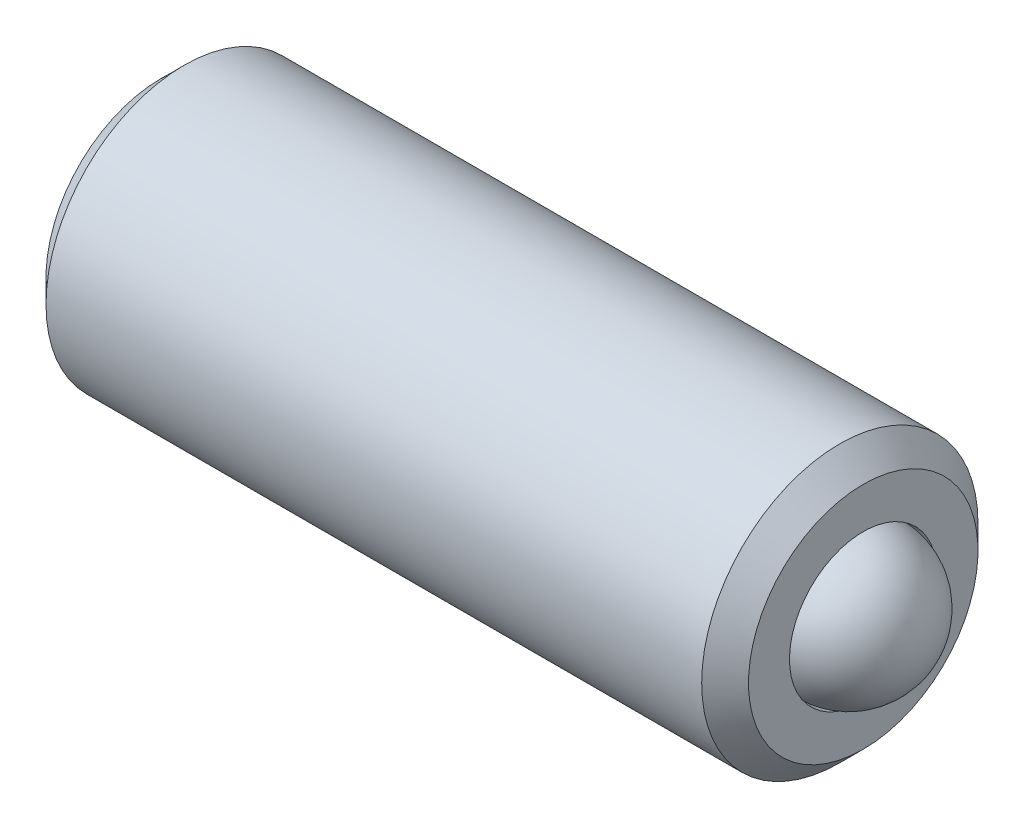
ISO-10303-21;
HEADER;
FILE_DESCRIPTION(('STEP AP214'),'2;1');
FILE_NAME('part.step','',(''),(''),'','','');
FILE_SCHEMA(('AUTOMOTIVE_DESIGN { 1 0 10303 214 1 1 1 1 }'));
ENDSEC;
DATA;
#1=APPLICATION_CONTEXT('core data for automotive mechanical design processes');
#2=APPLICATION_PROTOCOL_DEFINITION('international standard','automotive_design',2000,#1);
#3=PRODUCT_CONTEXT('',#1,'mechanical');
#4=PRODUCT('Part','Part','',(#3));
#5=PRODUCT_RELATED_PRODUCT_CATEGORY('part','',(#4));
#6=PRODUCT_DEFINITION_FORMATION('','',#4);
#7=PRODUCT_DEFINITION_CONTEXT('part definition',#1,'design');
#8=PRODUCT_DEFINITION('design','',#6,#7);
#9=PRODUCT_DEFINITION_SHAPE('','',#8);
#10=(LENGTH_UNIT() NAMED_UNIT(*) SI_UNIT(.MILLI.,.METRE.));
#11=(NAMED_UNIT(*) PLANE_ANGLE_UNIT() SI_UNIT($,.RADIAN.));
#12=(NAMED_UNIT(*) SI_UNIT($,.STERADIAN.) SOLID_ANGLE_UNIT());
#13=UNCERTAINTY_MEASURE_WITH_UNIT(LENGTH_MEASURE(1.E-05),#10,'distance_accuracy_value','');
#14=(GEOMETRIC_REPRESENTATION_CONTEXT(3) GLOBAL_UNCERTAINTY_ASSIGNED_CONTEXT((#13)) GLOBAL_UNIT_ASSIGNED_CONTEXT((#10,
#11,#12)) REPRESENTATION_CONTEXT('',''));
#15=CARTESIAN_POINT('',(0.,0.,0.));
#16=DIRECTION('',(0.,0.,1.));
#17=DIRECTION('',(1.,0.,0.));
#18=AXIS2_PLACEMENT_3D('',#15,#16,#17);
#19=CARTESIAN_POINT('',(-16.0036661282805,16.7837039818437,-1.19850984208369));
#20=DIRECTION('',(-1.,0.,0.));
#21=DIRECTION('',(0.,-1.,0.));
#22=AXIS2_PLACEMENT_3D('',#19,#20,#21);
#23=SPHERICAL_SURFACE('',#22,0.79375000000001);
#24=CARTESIAN_POINT('',(-16.7974161282805,16.7837039818437,-1.19850984208369));
#25=VERTEX_POINT('',#24);
#26=VERTEX_LOOP('',#25);
#27=FACE_BOUND('',#26,.T.);
#28=ADVANCED_FACE('P0_F12',(#27),#23,.T.);
#29=CLOSED_SHELL('',(#28));
#30=MANIFOLD_SOLID_BREP('P0_B1',#29);
#31=CARTESIAN_POINT('',(-23.4649161282804,16.7837039818437,-1.19850984208369));
#32=DIRECTION('',(1.,0.,0.));
#33=DIRECTION('',(0.,1.,0.));
#34=AXIS2_PLACEMENT_3D('',#31,#32,#33);
#35=PLANE('',#34);
#36=CARTESIAN_POINT('',(-23.4649161282804,16.7837039818437,-1.19850984208371));
#37=DIRECTION('',(-1.,0.,0.));
#38=DIRECTION('',(0.,0.,1.));
#39=AXIS2_PLACEMENT_3D('',#36,#37,#38);
#40=CIRCLE('',#39,0.952500000000023);
#41=CARTESIAN_POINT('',(-23.4649161282804,16.7837039818437,-0.246009842083686));
#42=VERTEX_POINT('',#41);
#43=EDGE_CURVE('P1_E141',#42,#42,#40,.T.);
#44=ORIENTED_EDGE('',*,*,#43,.F.);
#45=EDGE_LOOP('',(#44));
#46=FACE_BOUND('',#45,.T.);
#47=CARTESIAN_POINT('',(-23.4649161282804,16.7837039818437,-1.19850984208369));
#48=DIRECTION('',(-1.,0.,0.));
#49=DIRECTION('',(0.,-1.,0.));
#50=AXIS2_PLACEMENT_3D('',#47,#48,#49);
#51=CIRCLE('',#50,1.24460000000001);
#52=CARTESIAN_POINT('',(-23.4649161282804,15.5391039818437,-1.19850984208369));
#53=VERTEX_POINT('',#52);
#54=EDGE_CURVE('P1_E29',#53,#53,#51,.T.);
#55=ORIENTED_EDGE('',*,*,#54,.T.);
#56=EDGE_LOOP('',(#55));
#57=FACE_BOUND('',#56,.T.);
#58=ADVANCED_FACE('P1_F16',(#46,#57),#35,.F.);
#59=CARTESIAN_POINT('',(-23.2109161282804,16.7837039818437,-1.19850984208369));
#60=DIRECTION('',(1.,0.,0.));
#61=DIRECTION('',(0.,1.,0.));
#62=AXIS2_PLACEMENT_3D('',#59,#60,#61);
#63=CONICAL_SURFACE('',#62,1.49860000000002,0.785398163397501);
#64=ORIENTED_EDGE('',*,*,#54,.F.);
#65=EDGE_LOOP('',(#64));
#66=FACE_BOUND('',#65,.T.);
#67=CARTESIAN_POINT('',(-23.2109161282804,16.7837039818437,-1.19850984208369));
#68=DIRECTION('',(-1.,0.,0.));
#69=DIRECTION('',(0.,-1.,0.));
#70=AXIS2_PLACEMENT_3D('',#67,#68,#69);
#71=CIRCLE('',#70,1.49860000000002);
#72=CARTESIAN_POINT('',(-23.2109161282804,15.2851039818437,-1.19850984208369));
#73=VERTEX_POINT('',#72);
#74=EDGE_CURVE('P1_E112',#73,#73,#71,.T.);
#75=ORIENTED_EDGE('',*,*,#74,.T.);
#76=EDGE_LOOP('',(#75));
#77=FACE_BOUND('',#76,.T.);
#78=ADVANCED_FACE('P1_F118',(#66,#77),#63,.T.);
#79=CARTESIAN_POINT('',(-23.4649161282804,16.7837039818437,-1.19850984208369));
#80=DIRECTION('',(-1.,0.,0.));
#81=DIRECTION('',(0.,-1.,0.));
#82=AXIS2_PLACEMENT_3D('',#79,#80,#81);
#83=CYLINDRICAL_SURFACE('',#82,1.49860000000001);
#84=CARTESIAN_POINT('',(-16.0989161282804,16.7837039818437,-1.19850984208369));
#85=DIRECTION('',(-1.,0.,0.));
#86=DIRECTION('',(0.,-1.,0.));
#87=AXIS2_PLACEMENT_3D('',#84,#85,#86);
#88=CIRCLE('',#87,1.49860000000001);
#89=CARTESIAN_POINT('',(-16.0989161282804,15.2851039818437,-1.19850984208369));
#90=VERTEX_POINT('',#89);
#91=EDGE_CURVE('P1_E109',#90,#90,#88,.T.);
#92=ORIENTED_EDGE('',*,*,#91,.T.);
#93=EDGE_LOOP('',(#92));
#94=FACE_BOUND('',#93,.T.);
#95=ORIENTED_EDGE('',*,*,#74,.F.);
#96=EDGE_LOOP('',(#95));
#97=FACE_BOUND('',#96,.T.);
#98=ADVANCED_FACE('P1_F121',(#94,#97),#83,.T.);
#99=CARTESIAN_POINT('',(-16.0989161282804,16.7837039818437,-1.19850984208369));
#100=DIRECTION('',(-1.,0.,0.));
#101=DIRECTION('',(0.,-1.,0.));
#102=AXIS2_PLACEMENT_3D('',#99,#100,#101);
#103=CONICAL_SURFACE('',#102,1.49860000000001,0.785398163397452);
#104=CARTESIAN_POINT('',(-15.8449161282804,16.7837039818437,-1.19850984208369));
#105=DIRECTION('',(-1.,0.,0.));
#106=DIRECTION('',(0.,-1.,0.));
#107=AXIS2_PLACEMENT_3D('',#104,#105,#106);
#108=CIRCLE('',#107,1.24460000000001);
#109=CARTESIAN_POINT('',(-15.8449161282804,15.5391039818437,-1.19850984208369));
#110=VERTEX_POINT('',#109);
#111=EDGE_CURVE('P1_E106',#110,#110,#108,.T.);
#112=ORIENTED_EDGE('',*,*,#111,.T.);
#113=EDGE_LOOP('',(#112));
#114=FACE_BOUND('',#113,.T.);
#115=ORIENTED_EDGE('',*,*,#91,.F.);
#116=EDGE_LOOP('',(#115));
#117=FACE_BOUND('',#116,.T.);
#118=ADVANCED_FACE('P1_F125',(#114,#117),#103,.T.);
#119=CARTESIAN_POINT('',(-15.8449161282804,16.783703981844,-1.19850984208369));
#120=DIRECTION('',(1.,0.,0.));
#121=DIRECTION('',(0.,1.,0.));
#122=AXIS2_PLACEMENT_3D('',#119,#120,#121);
#123=PLANE('',#122);
#124=CARTESIAN_POINT('',(-15.8449161282804,16.7837039818437,-1.19850984208369));
#125=DIRECTION('',(-1.,0.,0.));
#126=DIRECTION('',(0.,-1.,0.));
#127=AXIS2_PLACEMENT_3D('',#124,#125,#126);
#128=CIRCLE('',#127,0.800100000000028);
#129=CARTESIAN_POINT('',(-15.8449161282804,15.9836039818437,-1.19850984208369));
#130=VERTEX_POINT('',#129);
#131=EDGE_CURVE('P1_E103',#130,#130,#128,.T.);
#132=ORIENTED_EDGE('',*,*,#131,.T.);
#133=EDGE_LOOP('',(#132));
#134=FACE_BOUND('',#133,.T.);
#135=ORIENTED_EDGE('',*,*,#111,.F.);
#136=EDGE_LOOP('',(#135));
#137=FACE_BOUND('',#136,.T.);
#138=ADVANCED_FACE('P1_F132',(#134,#137),#123,.T.);
#139=CARTESIAN_POINT('',(-23.4649161282804,16.7837039818437,-1.19850984208369));
#140=DIRECTION('',(-1.,0.,0.));
#141=DIRECTION('',(0.,-1.,0.));
#142=AXIS2_PLACEMENT_3D('',#139,#140,#141);
#143=CYLINDRICAL_SURFACE('',#142,0.80010000000002);
#144=CARTESIAN_POINT('',(-16.3260981434141,16.7837039818437,-1.19850984208369));
#145=DIRECTION('',(-1.,0.,0.));
#146=DIRECTION('',(0.,-1.,0.));
#147=AXIS2_PLACEMENT_3D('',#144,#145,#146);
#148=CIRCLE('',#147,0.800100000000012);
#149=CARTESIAN_POINT('',(-16.3260981434141,15.9836039818437,-1.19850984208369));
#150=VERTEX_POINT('',#149);
#151=EDGE_CURVE('P1_E100',#150,#150,#148,.T.);
#152=ORIENTED_EDGE('',*,*,#151,.T.);
#153=EDGE_LOOP('',(#152));
#154=FACE_BOUND('',#153,.T.);
#155=ORIENTED_EDGE('',*,*,#131,.F.);
#156=EDGE_LOOP('',(#155));
#157=FACE_BOUND('',#156,.T.);
#158=ADVANCED_FACE('P1_F241',(#154,#157),#143,.F.);
#159=CARTESIAN_POINT('',(-16.3260981434141,16.7837039818437,-1.19850984208369));
#160=DIRECTION('',(1.,0.,0.));
#161=DIRECTION('',(0.,1.,0.));
#162=AXIS2_PLACEMENT_3D('',#159,#160,#161);
#163=CONICAL_SURFACE('',#162,0.800100000000012,0.785398163397454);
#164=CARTESIAN_POINT('',(-17.1261981434141,16.7837039818437,-1.19850984208369));
#165=VERTEX_POINT('',#164);
#166=VERTEX_LOOP('',#165);
#167=FACE_BOUND('',#166,.T.);
#168=ORIENTED_EDGE('',*,*,#151,.F.);
#169=EDGE_LOOP('',(#168));
#170=FACE_BOUND('',#169,.T.);
#171=ADVANCED_FACE('P1_F164',(#167,#170),#163,.F.);
#172=CARTESIAN_POINT('',(-23.4649161282804,16.7837039818437,-1.19850984208371));
#173=DIRECTION('',(-1.,0.,0.));
#174=DIRECTION('',(0.,0.,1.));
#175=AXIS2_PLACEMENT_3D('',#172,#173,#174);
#176=CONICAL_SURFACE('',#175,0.952500000000023,0.78539816339745);
#177=ORIENTED_EDGE('',*,*,#43,.T.);
#178=EDGE_LOOP('',(#177));
#179=FACE_BOUND('',#178,.T.);
#180=CARTESIAN_POINT('',(-23.2618316250217,17.5331194518975,-1.19870984208371));
#181=CARTESIAN_POINT('',(-23.2489550419246,17.520235010343,-1.176393334684));
#182=CARTESIAN_POINT('',(-23.2368331220587,17.5071359403417,-1.15370507990997));
#183=CARTESIAN_POINT('',(-23.2146373575626,17.4804251777366,-1.10744068196904));
#184=CARTESIAN_POINT('',(-23.2045758749636,17.466810940165,-1.0838601307886));
#185=CARTESIAN_POINT('',(-23.1873423052965,17.4393566827924,-1.03630796213526));
#186=CARTESIAN_POINT('',(-23.180126821193,17.4255236945623,-1.01234852370026));
#187=CARTESIAN_POINT('',(-23.1690006814042,17.3975597645173,-0.963913576082889));
#188=CARTESIAN_POINT('',(-23.1650817387919,17.3834296619056,-0.939439520443362));
#189=CARTESIAN_POINT('',(-23.1601097937295,17.3489157595999,-0.87965968808239));
#190=CARTESIAN_POINT('',(-23.1610093299175,17.3284513433023,-0.844214279307727));
#191=CARTESIAN_POINT('',(-23.1702778713378,17.2879514682883,-0.774066438083356));
#192=CARTESIAN_POINT('',(-23.178658030564,17.2679166958897,-0.739365194370872));
#193=CARTESIAN_POINT('',(-23.1988671069507,17.2327316410986,-0.678422891805566));
#194=CARTESIAN_POINT('',(-23.2096418298755,17.2174196006326,-0.651901659750851));
#195=CARTESIAN_POINT('',(-23.2339147438423,17.1873954837112,-0.599898363790611));
#196=CARTESIAN_POINT('',(-23.2474040758273,17.1726816381242,-0.57441323565922));
#197=CARTESIAN_POINT('',(-23.2618316250217,17.1582385117899,-0.549397007028016));
#198=B_SPLINE_CURVE_WITH_KNOTS('',3,(#180,#181,#182,#183,#184,#185,#186,#187,#188,#189,#190,
#191,#192,#193,#194,#195,#196,#197),.UNSPECIFIED.,.F.,.F.,(4,2,2,2,2,2,2,2,4),(0.,
0.0864788641253346,0.173462284806165,0.259062693136953,0.344447268473231,0.466486555643647,
0.588708114182826,0.685962692863729,0.782904885826139),.UNSPECIFIED.);
#199=CARTESIAN_POINT('',(-23.2617161282804,17.5330039818437,-1.19850984208371));
#200=VERTEX_POINT('',#199);
#201=CARTESIAN_POINT('',(-23.2617161282804,17.1583539818437,-0.549597007028016));
#202=VERTEX_POINT('',#201);
#203=EDGE_CURVE('P1_E85',#200,#202,#198,.T.);
#204=ORIENTED_EDGE('',*,*,#203,.T.);
#205=CARTESIAN_POINT('',(-24.9739553494203,14.4092382588419,-0.549597007028115));
#206=CARTESIAN_POINT('',(-24.9162129079446,14.4691033455408,-0.549597007028112));
#207=CARTESIAN_POINT('',(-24.8585439739931,14.5290396665799,-0.54959700702811));
#208=CARTESIAN_POINT('',(-24.7434021511429,14.649106411897,-0.549597007028106));
#209=CARTESIAN_POINT('',(-24.6859292728778,14.7092368463697,-0.549597007028104));
#210=CARTESIAN_POINT('',(-24.5710755159701,14.8299043845783,-0.5495970070281));
#211=CARTESIAN_POINT('',(-24.5136953360286,14.8904421539257,-0.549597007028097));
#212=CARTESIAN_POINT('',(-24.399269980978,15.011829083006,-0.549597007028093));
#213=CARTESIAN_POINT('',(-24.3422247921954,15.072678229837,-0.549597007028091));
#214=CARTESIAN_POINT('',(-24.2214398193986,15.2024673823265,-0.549597007028086));
#215=CARTESIAN_POINT('',(-24.1577597667731,15.2714630567787,-0.549597007028084));
#216=CARTESIAN_POINT('',(-24.0312123536207,15.4102162971048,-0.549597007028079));
#217=CARTESIAN_POINT('',(-23.9683451058613,15.4799739662717,-0.549597007028076));
#218=CARTESIAN_POINT('',(-23.8439836993196,15.6204955025999,-0.549597007028071));
#219=CARTESIAN_POINT('',(-23.7824874051301,15.6912574759963,-0.549597007028069));
#220=CARTESIAN_POINT('',(-23.6615623401077,15.8345183539173,-0.549597007028063));
#221=CARTESIAN_POINT('',(-23.6021329434736,15.907016721282,-0.549597007028061));
#222=CARTESIAN_POINT('',(-23.509830832673,16.0257286746345,-0.549597007028057));
#223=CARTESIAN_POINT('',(-23.475750966889,16.0709975950446,-0.549597007028055));
#224=CARTESIAN_POINT('',(-23.4096818275872,16.1631876081487,-0.549597007028052));
#225=CARTESIAN_POINT('',(-23.3776964948896,16.210111573325,-0.54959700702805));
#226=CARTESIAN_POINT('',(-23.3178434019184,16.3051971368088,-0.549597007028046));
#227=CARTESIAN_POINT('',(-23.2899040535273,16.3533129415812,-0.549597007028045));
#228=CARTESIAN_POINT('',(-23.239767267835,16.4523935062724,-0.549597007028041));
#229=CARTESIAN_POINT('',(-23.2175477949664,16.5033463842668,-0.549597007028039));
#230=CARTESIAN_POINT('',(-23.1894545225992,16.5882243165813,-0.549597007028036));
#231=CARTESIAN_POINT('',(-23.1805819443804,16.6211292705176,-0.549597007028035));
#232=CARTESIAN_POINT('',(-23.1675643455832,16.6878051475961,-0.549597007028033));
#233=CARTESIAN_POINT('',(-23.1634064012769,16.7215734427071,-0.549597007028032));
#234=CARTESIAN_POINT('',(-23.1601505509814,16.7969829350093,-0.549597007028029));
#235=CARTESIAN_POINT('',(-23.1623971423535,16.838690764715,-0.549597007028027));
#236=CARTESIAN_POINT('',(-23.174443016596,16.9211060234123,-0.549597007028024));
#237=CARTESIAN_POINT('',(-23.1842754469344,16.9618082505968,-0.549597007028023));
#238=CARTESIAN_POINT('',(-23.2069699068764,17.0331400633901,-0.549597007028021));
#239=CARTESIAN_POINT('',(-23.2187933081849,17.0641199396153,-0.549597007028019));
#240=CARTESIAN_POINT('',(-23.2450738167802,17.1249550446671,-0.549597007028017));
#241=CARTESIAN_POINT('',(-23.2595330925753,17.1548093228879,-0.549597007028016));
#242=CARTESIAN_POINT('',(-23.2905091691146,17.2137940974906,-0.549597007028014));
#243=CARTESIAN_POINT('',(-23.3070450759384,17.2429143879802,-0.549597007028013));
#244=CARTESIAN_POINT('',(-23.3415231399447,17.300284022785,-0.549597007028011));
#245=CARTESIAN_POINT('',(-23.3594646750901,17.3285337447299,-0.54959700702801));
#246=CARTESIAN_POINT('',(-23.40131834725,17.3917860148084,-0.549597007028008));
#247=CARTESIAN_POINT('',(-23.4255459796205,17.4265785474448,-0.549597007028006));
#248=CARTESIAN_POINT('',(-23.4751814387298,17.4953149964402,-0.549597007028004));
#249=CARTESIAN_POINT('',(-23.5005895310987,17.5292587191286,-0.549597007028003));
#250=CARTESIAN_POINT('',(-23.5781145284378,17.6301676661983,-0.549597007027999));
#251=CARTESIAN_POINT('',(-23.6314956988711,17.6961579522711,-0.549597007027997));
#252=CARTESIAN_POINT('',(-23.7403321741694,17.8267644745017,-0.549597007027992));
#253=CARTESIAN_POINT('',(-23.7957939890199,17.8913751958962,-0.54959700702799));
#254=CARTESIAN_POINT('',(-23.9078926498964,18.019515077058,-0.549597007027985));
#255=CARTESIAN_POINT('',(-23.9645289499814,18.0830447154095,-0.549597007027983));
#256=CARTESIAN_POINT('',(-24.072285343644,18.2023946041017,-0.549597007027978));
#257=CARTESIAN_POINT('',(-24.1233224427375,18.2582901317845,-0.549597007027977));
#258=CARTESIAN_POINT('',(-24.2258613748827,18.3696671015383,-0.549597007027972));
#259=CARTESIAN_POINT('',(-24.2773632706748,18.4251484858022,-0.54959700702797));
#260=CARTESIAN_POINT('',(-24.3803629969416,18.5354242880679,-0.549597007027967));
#261=CARTESIAN_POINT('',(-24.4318585676312,18.5902208201663,-0.549597007027965));
#262=CARTESIAN_POINT('',(-24.5351036908169,18.6995570184242,-0.549597007027961));
#263=CARTESIAN_POINT('',(-24.5868531998021,18.7540967256527,-0.549597007027959));
#264=CARTESIAN_POINT('',(-24.6386973535117,18.8085456994283,-0.549597007027957));
#265=B_SPLINE_CURVE_WITH_KNOTS('',3,(#205,#206,#207,#208,#209,#210,#211,#212,#213,#214,#215,
#216,#217,#218,#219,#220,#221,#222,#223,#224,#225,#226,#227,#228,#229,#230,#231,#232,#233,#234,
#235,#236,#237,#238,#239,#240,#241,#242,#243,#244,#245,#246,#247,#248,#249,#250,#251,#252,#253,
#254,#255,#256,#257,#258,#259,#260,#261,#262,#263,#264),.UNSPECIFIED.,.F.,.F.,(4,2,2,2,2,2,2,2,
2,2,2,2,2,2,2,2,2,2,2,2,2,2,2,2,2,2,2,2,2,4),(0.,0.249524170139364,0.499061665439864,
0.749292128124689,0.999512305079418,1.28118188807046,1.56289013898527,1.84412365169307,
2.125271259699,2.29522422965679,2.46548828307588,2.63222422694829,2.79830787602708,
2.90027530607566,3.0019625426852,3.12646325615384,3.25151109710588,3.35084711325208,
3.45026522403926,3.55067620936327,3.65104300779616,3.77819720609631,3.90538015687358,
4.15993807683352,4.41537266859039,4.67069107513106,4.89776066192222,5.12486137221031,
5.35044877184562,5.57599878142068),.UNSPECIFIED.);
#266=CARTESIAN_POINT('',(-23.2617161282804,16.4090539818437,-0.549597007028043));
#267=VERTEX_POINT('',#266);
#268=EDGE_CURVE('P1_E171',#202,#267,#265,.F.);
#269=ORIENTED_EDGE('',*,*,#268,.T.);
#270=CARTESIAN_POINT('',(-23.2618316250217,16.4091694518975,-0.549397007028043));
#271=CARTESIAN_POINT('',(-23.2489550419246,16.3962850103429,-0.571713514427752));
#272=CARTESIAN_POINT('',(-23.2368331220586,16.3831859403417,-0.594401769201784));
#273=CARTESIAN_POINT('',(-23.2146373575626,16.3564751777366,-0.640666167142707));
#274=CARTESIAN_POINT('',(-23.2045758749636,16.342860940165,-0.664246718323149));
#275=CARTESIAN_POINT('',(-23.1873423052965,16.3154066827924,-0.711798886976482));
#276=CARTESIAN_POINT('',(-23.180126821193,16.3015736945623,-0.735758325411486));
#277=CARTESIAN_POINT('',(-23.1690006814042,16.2736097645172,-0.784193273028851));
#278=CARTESIAN_POINT('',(-23.1650817387919,16.2594796619056,-0.808667328668378));
#279=CARTESIAN_POINT('',(-23.1601097937295,16.2249657595999,-0.868447161029349));
#280=CARTESIAN_POINT('',(-23.1610093299174,16.2045013433023,-0.90389256980401));
#281=CARTESIAN_POINT('',(-23.1702778713377,16.1640014682883,-0.974040411028379));
#282=CARTESIAN_POINT('',(-23.178658030564,16.1439666958897,-1.00874165474086));
#283=CARTESIAN_POINT('',(-23.1988671069506,16.1087816410986,-1.06968395730617));
#284=CARTESIAN_POINT('',(-23.2096418298755,16.0934696006326,-1.09620518936089));
#285=CARTESIAN_POINT('',(-23.2339147438423,16.0634454837112,-1.14820848532113));
#286=CARTESIAN_POINT('',(-23.2474040758273,16.0487316381242,-1.17369361345252));
#287=CARTESIAN_POINT('',(-23.2618316250217,16.0342885117899,-1.19870984208372));
#288=B_SPLINE_CURVE_WITH_KNOTS('',3,(#270,#271,#272,#273,#274,#275,#276,#277,#278,#279,#280,
#281,#282,#283,#284,#285,#286,#287),.UNSPECIFIED.,.F.,.F.,(4,2,2,2,2,2,2,2,4),(0.,
0.086478864125331,0.173462284806158,0.25906269313694,0.344447268473215,0.466486555643629,
0.588708114182806,0.685962692863711,0.782904885826126),.UNSPECIFIED.);
#289=CARTESIAN_POINT('',(-23.2617161282804,16.0344039818437,-1.19850984208372));
#290=VERTEX_POINT('',#289);
#291=EDGE_CURVE('P1_E144',#267,#290,#288,.T.);
#292=ORIENTED_EDGE('',*,*,#291,.T.);
#293=CARTESIAN_POINT('',(-23.2618316250217,16.4091694518975,-1.8476226771394));
#294=CARTESIAN_POINT('',(-23.2489550419246,16.3962850103429,-1.82530616973969));
#295=CARTESIAN_POINT('',(-23.2368331220587,16.3831859403417,-1.80261791496566));
#296=CARTESIAN_POINT('',(-23.2146373575626,16.3564751777366,-1.75635351702473));
#297=CARTESIAN_POINT('',(-23.2045758749636,16.342860940165,-1.73277296584429));
#298=CARTESIAN_POINT('',(-23.1873423052965,16.3154066827924,-1.68522079719095));
#299=CARTESIAN_POINT('',(-23.180126821193,16.3015736945623,-1.66126135875595));
#300=CARTESIAN_POINT('',(-23.1690006814042,16.2736097645172,-1.61282641113858));
#301=CARTESIAN_POINT('',(-23.1650817387919,16.2594796619056,-1.58835235549905));
#302=CARTESIAN_POINT('',(-23.1601097937295,16.2249657595999,-1.52857252313808));
#303=CARTESIAN_POINT('',(-23.1610093299175,16.2045013433023,-1.49312711436342));
#304=CARTESIAN_POINT('',(-23.1702778713378,16.1640014682883,-1.42297927313905));
#305=CARTESIAN_POINT('',(-23.178658030564,16.1439666958897,-1.38827802942656));
#306=CARTESIAN_POINT('',(-23.1988671069507,16.1087816410986,-1.32733572686126));
#307=CARTESIAN_POINT('',(-23.2096418298755,16.0934696006326,-1.30081449480655));
#308=CARTESIAN_POINT('',(-23.2339147438423,16.0634454837112,-1.24881119884631));
#309=CARTESIAN_POINT('',(-23.2474040758273,16.0487316381242,-1.22332607071492));
#310=CARTESIAN_POINT('',(-23.2618316250217,16.0342885117899,-1.19830984208372));
#311=B_SPLINE_CURVE_WITH_KNOTS('',3,(#293,#294,#295,#296,#297,#298,#299,#300,#301,#302,#303,
#304,#305,#306,#307,#308,#309,#310),.UNSPECIFIED.,.F.,.F.,(4,2,2,2,2,2,2,2,4),(0.,
0.0864788641253366,0.173462284806167,0.259062693136956,0.344447268473237,0.466486555643652,
0.588708114182833,0.685962692863723,0.782904885826125),.UNSPECIFIED.);
#312=CARTESIAN_POINT('',(-23.2617161282804,16.4090539818437,-1.8474226771394));
#313=VERTEX_POINT('',#312);
#314=EDGE_CURVE('P1_E36',#313,#290,#311,.T.);
#315=ORIENTED_EDGE('',*,*,#314,.F.);
#316=CARTESIAN_POINT('',(-24.9739553472225,14.4092382611204,-1.8474226771394));
#317=CARTESIAN_POINT('',(-24.9162129059096,14.4691033476544,-1.8474226771394));
#318=CARTESIAN_POINT('',(-24.8585439721208,14.5290396685284,-1.8474226771394));
#319=CARTESIAN_POINT('',(-24.7434021495955,14.6491064135146,-1.8474226771394));
#320=CARTESIAN_POINT('',(-24.6859292714925,14.7092368478215,-1.8474226771394));
#321=CARTESIAN_POINT('',(-24.5710755149099,14.8299043856958,-1.8474226771394));
#322=CARTESIAN_POINT('',(-24.5136953351313,14.8904421548747,-1.8474226771394));
#323=CARTESIAN_POINT('',(-24.399269980405,15.0118290836167,-1.8474226771394));
#324=CARTESIAN_POINT('',(-24.3422247917839,15.0726782302779,-1.8474226771394));
#325=CARTESIAN_POINT('',(-24.2214398193327,15.2024673823989,-1.8474226771394));
#326=CARTESIAN_POINT('',(-24.1577597668909,15.2714630566522,-1.8474226771394));
#327=CARTESIAN_POINT('',(-24.0312123541011,15.4102162965755,-1.8474226771394));
#328=CARTESIAN_POINT('',(-23.9683451065205,15.4799739655385,-1.8474226771394));
#329=CARTESIAN_POINT('',(-23.8439837003258,15.6204955014512,-1.8474226771394));
#330=CARTESIAN_POINT('',(-23.7824874063046,15.6912574746361,-1.8474226771394));
#331=CARTESIAN_POINT('',(-23.6615623415992,15.8345183521184,-1.8474226771394));
#332=CARTESIAN_POINT('',(-23.6021329451138,15.9070167192559,-1.8474226771394));
#333=CARTESIAN_POINT('',(-23.5098308342282,16.0257286725845,-1.8474226771394));
#334=CARTESIAN_POINT('',(-23.4757509682368,16.0709975932174,-1.8474226771394));
#335=CARTESIAN_POINT('',(-23.4096818285301,16.1631876067791,-1.8474226771394));
#336=CARTESIAN_POINT('',(-23.3776964956349,16.2101115721902,-1.8474226771394));
#337=CARTESIAN_POINT('',(-23.3178434023042,16.3051971361473,-1.8474226771394));
#338=CARTESIAN_POINT('',(-23.2899040537499,16.3533129411575,-1.8474226771394));
#339=CARTESIAN_POINT('',(-23.2397672677864,16.4523935063523,-1.8474226771394));
#340=CARTESIAN_POINT('',(-23.2175477948093,16.5033463846122,-1.8474226771394));
#341=CARTESIAN_POINT('',(-23.1894545224799,16.5882243170207,-1.8474226771394));
#342=CARTESIAN_POINT('',(-23.1805819443308,16.6211292707621,-1.8474226771394));
#343=CARTESIAN_POINT('',(-23.1675643456154,16.6878051474405,-1.8474226771394));
#344=CARTESIAN_POINT('',(-23.1634064013217,16.7215734423463,-1.8474226771394));
#345=CARTESIAN_POINT('',(-23.1601505509629,16.7969829346193,-1.8474226771394));
#346=CARTESIAN_POINT('',(-23.1623971423253,16.8386907645058,-1.8474226771394));
#347=CARTESIAN_POINT('',(-23.1744430166147,16.9211060235566,-1.8474226771394));
#348=CARTESIAN_POINT('',(-23.1842754470103,16.9618082509138,-1.8474226771394));
#349=CARTESIAN_POINT('',(-23.2069699070618,17.0331400639103,-1.8474226771394));
#350=CARTESIAN_POINT('',(-23.2187933084053,17.0641199401727,-1.8474226771394));
#351=CARTESIAN_POINT('',(-23.2450738170725,17.1249550452963,-1.8474226771394));
#352=CARTESIAN_POINT('',(-23.2595330929045,17.1548093235518,-1.8474226771394));
#353=CARTESIAN_POINT('',(-23.2905091695181,17.2137940982216,-1.8474226771394));
#354=CARTESIAN_POINT('',(-23.3070450763792,17.2429143887436,-1.8474226771394));
#355=CARTESIAN_POINT('',(-23.34152314046,17.3002840236126,-1.8474226771394));
#356=CARTESIAN_POINT('',(-23.3594646756426,17.3285337455893,-1.8474226771394));
#357=CARTESIAN_POINT('',(-23.4013183479,17.3917860157598,-1.8474226771394));
#358=CARTESIAN_POINT('',(-23.4255459803317,17.4265785484558,-1.8474226771394));
#359=CARTESIAN_POINT('',(-23.4751814395639,17.4953149975694,-1.8474226771394));
#360=CARTESIAN_POINT('',(-23.5005895319945,17.5292587203164,-1.8474226771394));
#361=CARTESIAN_POINT('',(-23.5781145295189,17.6301676675611,-1.8474226771394));
#362=CARTESIAN_POINT('',(-23.6314957000758,17.6961579537496,-1.8474226771394));
#363=CARTESIAN_POINT('',(-23.7403321756208,17.8267644762111,-1.8474226771394));
#364=CARTESIAN_POINT('',(-23.7957939905943,17.8913751977209,-1.8474226771394));
#365=CARTESIAN_POINT('',(-23.9078926517162,18.0195150791134,-1.8474226771394));
#366=CARTESIAN_POINT('',(-23.9645289519235,18.0830447175803,-1.8474226771394));
#367=CARTESIAN_POINT('',(-24.0722853458188,18.2023946064932,-1.8474226771394));
#368=CARTESIAN_POINT('',(-24.1233224450228,18.2582901342812,-1.8474226771394));
#369=CARTESIAN_POINT('',(-24.2258613773886,18.3696671042457,-1.8474226771394));
#370=CARTESIAN_POINT('',(-24.2773632732907,18.425148488615,-1.8474226771394));
#371=CARTESIAN_POINT('',(-24.3803629997777,18.5354242910922,-1.8474226771394));
#372=CARTESIAN_POINT('',(-24.4318585705773,18.5902208232967,-1.8474226771394));
#373=CARTESIAN_POINT('',(-24.5351036939828,18.6995570217668,-1.8474226771394));
#374=CARTESIAN_POINT('',(-24.5868532030778,18.7540967291015,-1.8474226771394));
#375=CARTESIAN_POINT('',(-24.6386973568971,18.8085457029833,-1.8474226771394));
#376=B_SPLINE_CURVE_WITH_KNOTS('',3,(#316,#317,#318,#319,#320,#321,#322,#323,#324,#325,#326,
#327,#328,#329,#330,#331,#332,#333,#334,#335,#336,#337,#338,#339,#340,#341,#342,#343,#344,#345,
#346,#347,#348,#349,#350,#351,#352,#353,#354,#355,#356,#357,#358,#359,#360,#361,#362,#363,#364,
#365,#366,#367,#368,#369,#370,#371,#372,#373,#374,#375),.UNSPECIFIED.,.F.,.F.,(4,2,2,2,2,2,2,2,
2,2,2,2,2,2,2,2,2,2,2,2,2,2,2,2,2,2,2,2,2,4),(0.,0.249524169444003,0.499061664048886,
0.7492921260306,0.999512302282453,1.28118188446102,1.56289013456251,1.84412364646026,
2.125271253658,2.29522422452394,2.46548827885783,2.63222422359163,2.79830787351792,
2.9002753029521,3.00196253895413,3.12646325295126,3.25151109444025,3.35084711072833,
3.4502652216572,3.55067620712132,3.65104300569431,3.7781972042461,3.90538015527503,
4.15993807573828,4.41537266799792,4.67069107504134,4.89776066228907,5.12486137303373,
5.35044877312689,5.5759987831598),.UNSPECIFIED.);
#377=CARTESIAN_POINT('',(-23.2617161282804,17.1583539818437,-1.8474226771394));
#378=VERTEX_POINT('',#377);
#379=EDGE_CURVE('P1_E11',#378,#313,#376,.F.);
#380=ORIENTED_EDGE('',*,*,#379,.F.);
#381=CARTESIAN_POINT('',(-23.2618316250217,17.5331194518975,-1.19830984208371));
#382=CARTESIAN_POINT('',(-23.2489550419246,17.520235010343,-1.22062634948342));
#383=CARTESIAN_POINT('',(-23.2368331220587,17.5071359403417,-1.24331460425745));
#384=CARTESIAN_POINT('',(-23.2146373575626,17.4804251777366,-1.28957900219837));
#385=CARTESIAN_POINT('',(-23.2045758749636,17.466810940165,-1.31315955337882));
#386=CARTESIAN_POINT('',(-23.1873423052965,17.4393566827924,-1.36071172203215));
#387=CARTESIAN_POINT('',(-23.180126821193,17.4255236945623,-1.38467116046716));
#388=CARTESIAN_POINT('',(-23.1690006814042,17.3975597645173,-1.43310610808453));
#389=CARTESIAN_POINT('',(-23.1650817387919,17.3834296619056,-1.45758016372405));
#390=CARTESIAN_POINT('',(-23.1601097937295,17.3489157595999,-1.51735999608503));
#391=CARTESIAN_POINT('',(-23.1610093299175,17.3284513433023,-1.55280540485969));
#392=CARTESIAN_POINT('',(-23.1702778713378,17.2879514682883,-1.62295324608406));
#393=CARTESIAN_POINT('',(-23.178658030564,17.2679166958897,-1.65765448979654));
#394=CARTESIAN_POINT('',(-23.1988671069507,17.2327316410986,-1.71859679236185));
#395=CARTESIAN_POINT('',(-23.2096418298755,17.2174196006326,-1.74511802441657));
#396=CARTESIAN_POINT('',(-23.2339147438423,17.1873954837112,-1.79712132037681));
#397=CARTESIAN_POINT('',(-23.2474040758273,17.1726816381242,-1.8226064485082));
#398=CARTESIAN_POINT('',(-23.2618316250217,17.1582385117899,-1.8476226771394));
#399=B_SPLINE_CURVE_WITH_KNOTS('',3,(#381,#382,#383,#384,#385,#386,#387,#388,#389,#390,#391,
#392,#393,#394,#395,#396,#397,#398),.UNSPECIFIED.,.F.,.F.,(4,2,2,2,2,2,2,2,4),(0.,
0.0864788641253344,0.173462284806165,0.259062693136952,0.344447268473231,0.466486555643647,
0.588708114182827,0.685962692863728,0.782904885826141),.UNSPECIFIED.);
#400=EDGE_CURVE('P1_E72',#200,#378,#399,.T.);
#401=ORIENTED_EDGE('',*,*,#400,.F.);
#402=EDGE_LOOP('',(#204,#269,#292,#315,#380,#401));
#403=FACE_BOUND('',#402,.T.);
#404=ADVANCED_FACE('P1_F71',(#179,#403),#176,.F.);
#405=CARTESIAN_POINT('',(-21.9409161282804,13.9041626256064,-1.19850984208369));
#406=DIRECTION('',(-1.,0.,0.));
#407=DIRECTION('',(0.,-1.,0.));
#408=AXIS2_PLACEMENT_3D('',#405,#406,#407);
#409=PLANE('',#408);
#410=DIRECTION('',(0.,-0.499999999999997,-0.866025403784441));
#411=VECTOR('',#410,1.);
#412=CARTESIAN_POINT('',(-21.9409161282804,16.6257936427844,-2.76984424248625));
#413=LINE('',#412,#411);
#414=CARTESIAN_POINT('',(-21.9409161282804,17.5330039818437,-1.19850984208371));
#415=VERTEX_POINT('',#414);
#416=CARTESIAN_POINT('',(-21.9409161282804,17.1583539818437,-1.8474226771394));
#417=VERTEX_POINT('',#416);
#418=EDGE_CURVE('P1_E84',#415,#417,#413,.T.);
#419=ORIENTED_EDGE('',*,*,#418,.T.);
#420=DIRECTION('',(0.,-1.,0.));
#421=VECTOR('',#420,1.);
#422=CARTESIAN_POINT('',(-21.9409161282804,13.9041626256064,-1.8474226771394));
#423=LINE('',#422,#421);
#424=CARTESIAN_POINT('',(-21.9409161282804,16.4090539818437,-1.8474226771394));
#425=VERTEX_POINT('',#424);
#426=EDGE_CURVE('P1_E89',#417,#425,#423,.T.);
#427=ORIENTED_EDGE('',*,*,#426,.T.);
#428=DIRECTION('',(0.,-0.5,0.866025403784439));
#429=VECTOR('',#428,1.);
#430=CARTESIAN_POINT('',(-21.9409161282804,15.5018436427844,-0.276088276736828));
#431=LINE('',#430,#429);
#432=CARTESIAN_POINT('',(-21.9409161282804,16.0344039818437,-1.19850984208372));
#433=VERTEX_POINT('',#432);
#434=EDGE_CURVE('P1_E223',#425,#433,#431,.T.);
#435=ORIENTED_EDGE('',*,*,#434,.T.);
#436=DIRECTION('',(0.,-0.5,-0.866025403784439));
#437=VECTOR('',#436,1.);
#438=CARTESIAN_POINT('',(-21.9409161282804,15.5018436427844,-2.12093140743057));
#439=LINE('',#438,#437);
#440=CARTESIAN_POINT('',(-21.9409161282804,16.4090539818437,-0.549597007028043));
#441=VERTEX_POINT('',#440);
#442=EDGE_CURVE('P1_E221',#441,#433,#439,.T.);
#443=ORIENTED_EDGE('',*,*,#442,.F.);
#444=DIRECTION('',(0.,-1.,0.));
#445=VECTOR('',#444,1.);
#446=CARTESIAN_POINT('',(-21.9409161282804,13.9041626256063,-0.549597007028133));
#447=LINE('',#446,#445);
#448=CARTESIAN_POINT('',(-21.9409161282804,17.1583539818437,-0.549597007028016));
#449=VERTEX_POINT('',#448);
#450=EDGE_CURVE('P1_E96',#449,#441,#447,.T.);
#451=ORIENTED_EDGE('',*,*,#450,.F.);
#452=DIRECTION('',(0.,-0.499999999999997,0.866025403784441));
#453=VECTOR('',#452,1.);
#454=CARTESIAN_POINT('',(-21.9409161282804,16.6257936427844,0.372824558318854));
#455=LINE('',#454,#453);
#456=EDGE_CURVE('P1_E92',#415,#449,#455,.T.);
#457=ORIENTED_EDGE('',*,*,#456,.F.);
#458=EDGE_LOOP('',(#419,#427,#435,#443,#451,#457));
#459=FACE_BOUND('',#458,.T.);
#460=ADVANCED_FACE('P1_F163',(#459),#409,.T.);
#461=CARTESIAN_POINT('',(-21.9409161282804,13.9041626256064,-1.8474226771394));
#462=DIRECTION('',(0.,0.,-1.));
#463=DIRECTION('',(-1.,0.,0.));
#464=AXIS2_PLACEMENT_3D('',#461,#462,#463);
#465=PLANE('',#464);
#466=DIRECTION('',(-1.,0.,0.));
#467=VECTOR('',#466,1.);
#468=CARTESIAN_POINT('',(-21.9409161282804,17.1583539818437,-1.8474226771394));
#469=LINE('',#468,#467);
#470=EDGE_CURVE('P1_E81',#417,#378,#469,.T.);
#471=ORIENTED_EDGE('',*,*,#470,.T.);
#472=ORIENTED_EDGE('',*,*,#379,.T.);
#473=DIRECTION('',(-1.,0.,0.));
#474=VECTOR('',#473,1.);
#475=CARTESIAN_POINT('',(-21.9409161282804,16.4090539818437,-1.8474226771394));
#476=LINE('',#475,#474);
#477=EDGE_CURVE('P1_E91',#425,#313,#476,.T.);
#478=ORIENTED_EDGE('',*,*,#477,.F.);
#479=ORIENTED_EDGE('',*,*,#426,.F.);
#480=EDGE_LOOP('',(#471,#472,#478,#479));
#481=FACE_BOUND('',#480,.T.);
#482=ADVANCED_FACE('P1_F87',(#481),#465,.F.);
#483=CARTESIAN_POINT('',(-21.9409161282804,15.5018436427844,-0.276088276736828));
#484=DIRECTION('',(0.,-0.866025403784439,-0.5));
#485=DIRECTION('',(0.,0.5,-0.866025403784439));
#486=AXIS2_PLACEMENT_3D('',#483,#484,#485);
#487=PLANE('',#486);
#488=ORIENTED_EDGE('',*,*,#477,.T.);
#489=ORIENTED_EDGE('',*,*,#314,.T.);
#490=DIRECTION('',(-1.,0.,0.));
#491=VECTOR('',#490,1.);
#492=CARTESIAN_POINT('',(-21.9409161282804,16.0344039818437,-1.19850984208372));
#493=LINE('',#492,#491);
#494=EDGE_CURVE('P1_E94',#433,#290,#493,.T.);
#495=ORIENTED_EDGE('',*,*,#494,.F.);
#496=ORIENTED_EDGE('',*,*,#434,.F.);
#497=EDGE_LOOP('',(#488,#489,#495,#496));
#498=FACE_BOUND('',#497,.T.);
#499=ADVANCED_FACE('P1_F158',(#498),#487,.F.);
#500=CARTESIAN_POINT('',(-21.9409161282804,15.5018436427844,-2.12093140743057));
#501=DIRECTION('',(0.,0.866025403784439,-0.5));
#502=DIRECTION('',(0.,0.5,0.866025403784439));
#503=AXIS2_PLACEMENT_3D('',#500,#501,#502);
#504=PLANE('',#503);
#505=ORIENTED_EDGE('',*,*,#291,.F.);
#506=DIRECTION('',(-1.,0.,0.));
#507=VECTOR('',#506,1.);
#508=CARTESIAN_POINT('',(-21.9409161282804,16.4090539818437,-0.549597007028043));
#509=LINE('',#508,#507);
#510=EDGE_CURVE('P1_E208',#441,#267,#509,.T.);
#511=ORIENTED_EDGE('',*,*,#510,.F.);
#512=ORIENTED_EDGE('',*,*,#442,.T.);
#513=ORIENTED_EDGE('',*,*,#494,.T.);
#514=EDGE_LOOP('',(#505,#511,#512,#513));
#515=FACE_BOUND('',#514,.T.);
#516=ADVANCED_FACE('P1_F195',(#515),#504,.T.);
#517=CARTESIAN_POINT('',(-21.9409161282804,13.9041626256063,-0.549597007028133));
#518=DIRECTION('',(0.,0.,-1.));
#519=DIRECTION('',(0.,1.,0.));
#520=AXIS2_PLACEMENT_3D('',#517,#518,#519);
#521=PLANE('',#520);
#522=ORIENTED_EDGE('',*,*,#268,.F.);
#523=DIRECTION('',(-1.,0.,0.));
#524=VECTOR('',#523,1.);
#525=CARTESIAN_POINT('',(-21.9409161282804,17.1583539818437,-0.549597007028016));
#526=LINE('',#525,#524);
#527=EDGE_CURVE('P1_E215',#449,#202,#526,.T.);
#528=ORIENTED_EDGE('',*,*,#527,.F.);
#529=ORIENTED_EDGE('',*,*,#450,.T.);
#530=ORIENTED_EDGE('',*,*,#510,.T.);
#531=EDGE_LOOP('',(#522,#528,#529,#530));
#532=FACE_BOUND('',#531,.T.);
#533=ADVANCED_FACE('P1_F191',(#532),#521,.T.);
#534=CARTESIAN_POINT('',(-21.9409161282804,16.6257936427844,0.372824558318854));
#535=DIRECTION('',(0.,-0.866025403784441,-0.499999999999997));
#536=DIRECTION('',(0.,0.499999999999997,-0.866025403784441));
#537=AXIS2_PLACEMENT_3D('',#534,#535,#536);
#538=PLANE('',#537);
#539=ORIENTED_EDGE('',*,*,#203,.F.);
#540=DIRECTION('',(-1.,0.,0.));
#541=VECTOR('',#540,1.);
#542=CARTESIAN_POINT('',(-21.9409161282804,17.5330039818437,-1.19850984208371));
#543=LINE('',#542,#541);
#544=EDGE_CURVE('P1_E83',#415,#200,#543,.T.);
#545=ORIENTED_EDGE('',*,*,#544,.F.);
#546=ORIENTED_EDGE('',*,*,#456,.T.);
#547=ORIENTED_EDGE('',*,*,#527,.T.);
#548=EDGE_LOOP('',(#539,#545,#546,#547));
#549=FACE_BOUND('',#548,.T.);
#550=ADVANCED_FACE('P1_F188',(#549),#538,.T.);
#551=CARTESIAN_POINT('',(-21.9409161282804,16.6257936427844,-2.76984424248625));
#552=DIRECTION('',(0.,0.866025403784441,-0.499999999999997));
#553=DIRECTION('',(0.,0.499999999999997,0.866025403784441));
#554=AXIS2_PLACEMENT_3D('',#551,#552,#553);
#555=PLANE('',#554);
#556=ORIENTED_EDGE('',*,*,#544,.T.);
#557=ORIENTED_EDGE('',*,*,#400,.T.);
#558=ORIENTED_EDGE('',*,*,#470,.F.);
#559=ORIENTED_EDGE('',*,*,#418,.F.);
#560=EDGE_LOOP('',(#556,#557,#558,#559));
#561=FACE_BOUND('',#560,.T.);
#562=ADVANCED_FACE('P1_F79',(#561),#555,.F.);
#563=CLOSED_SHELL('',(#58,#78,#98,#118,#138,#158,#171,#404,#460,#482,#499,#516,#533,#550,#562));
#564=MANIFOLD_SOLID_BREP('P1_B1',#563);
#565=ADVANCED_BREP_SHAPE_REPRESENTATION('',(#18,#30,#564),#14);
#566=SHAPE_DEFINITION_REPRESENTATION(#9,#565);
ENDSEC;
END-ISO-10303-21;
